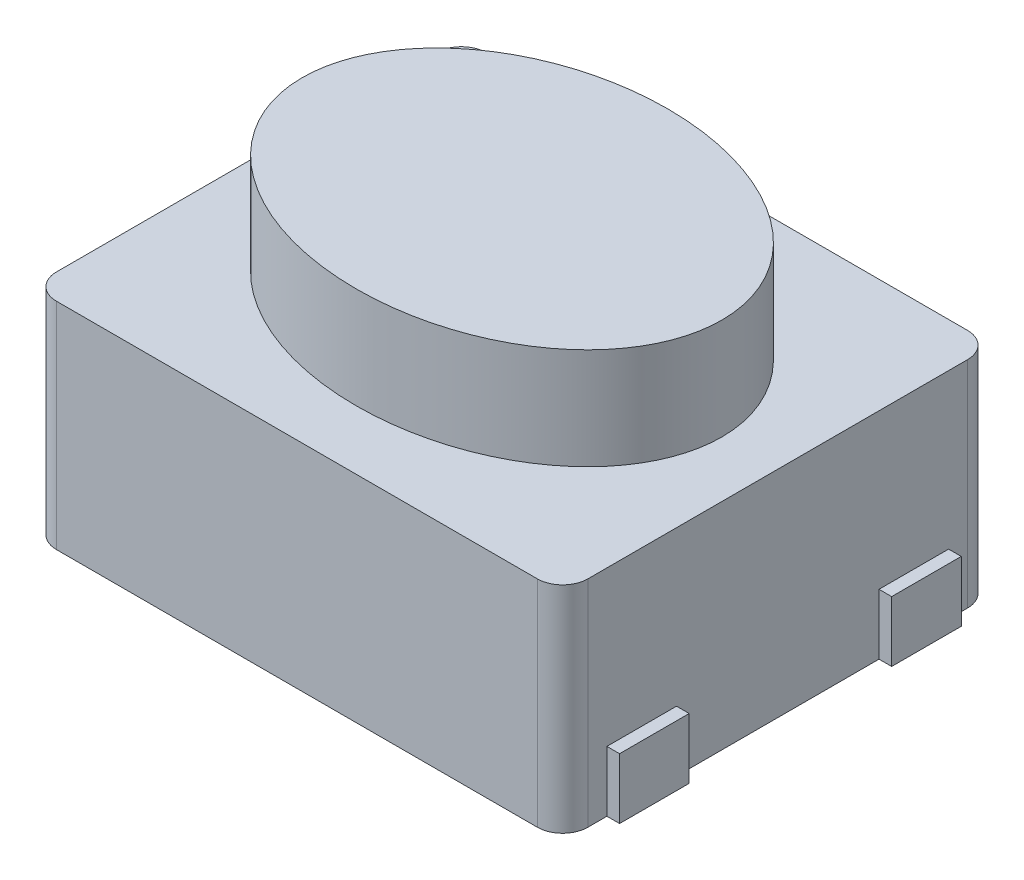
ISO-10303-21;
HEADER;
FILE_DESCRIPTION(('STEP AP214'),'2;1');
FILE_NAME('part.step','',(''),(''),'','','');
FILE_SCHEMA(('AUTOMOTIVE_DESIGN { 1 0 10303 214 1 1 1 1 }'));
ENDSEC;
DATA;
#1=APPLICATION_CONTEXT('core data for automotive mechanical design processes');
#2=APPLICATION_PROTOCOL_DEFINITION('international standard','automotive_design',2000,#1);
#3=PRODUCT_CONTEXT('',#1,'mechanical');
#4=PRODUCT('Part','Part','',(#3));
#5=PRODUCT_RELATED_PRODUCT_CATEGORY('part','',(#4));
#6=PRODUCT_DEFINITION_FORMATION('','',#4);
#7=PRODUCT_DEFINITION_CONTEXT('part definition',#1,'design');
#8=PRODUCT_DEFINITION('design','',#6,#7);
#9=PRODUCT_DEFINITION_SHAPE('','',#8);
#10=(LENGTH_UNIT() NAMED_UNIT(*) SI_UNIT(.MILLI.,.METRE.));
#11=(NAMED_UNIT(*) PLANE_ANGLE_UNIT() SI_UNIT($,.RADIAN.));
#12=(NAMED_UNIT(*) SI_UNIT($,.STERADIAN.) SOLID_ANGLE_UNIT());
#13=UNCERTAINTY_MEASURE_WITH_UNIT(LENGTH_MEASURE(1.E-05),#10,'distance_accuracy_value','');
#14=(GEOMETRIC_REPRESENTATION_CONTEXT(3) GLOBAL_UNCERTAINTY_ASSIGNED_CONTEXT((#13)) GLOBAL_UNIT_ASSIGNED_CONTEXT((#10,
#11,#12)) REPRESENTATION_CONTEXT('',''));
#15=CARTESIAN_POINT('',(0.,0.,0.));
#16=DIRECTION('',(0.,0.,1.));
#17=DIRECTION('',(1.,0.,0.));
#18=AXIS2_PLACEMENT_3D('',#15,#16,#17);
#19=CARTESIAN_POINT('',(-2.1,1.7,1.7));
#20=DIRECTION('',(1.,0.,0.));
#21=DIRECTION('',(0.,0.,-1.));
#22=AXIS2_PLACEMENT_3D('',#19,#20,#21);
#23=PLANE('',#22);
#24=DIRECTION('',(0.,1.,0.));
#25=VECTOR('',#24,1.);
#26=CARTESIAN_POINT('',(-2.1,0.478335134016182,1.35));
#27=LINE('',#26,#25);
#28=CARTESIAN_POINT('',(-2.1,0.,1.35));
#29=VERTEX_POINT('',#28);
#30=CARTESIAN_POINT('',(-2.1,0.478335134016182,1.35));
#31=VERTEX_POINT('',#30);
#32=EDGE_CURVE('E290',#29,#31,#27,.T.);
#33=ORIENTED_EDGE('',*,*,#32,.F.);
#34=DIRECTION('',(0.,0.,1.));
#35=VECTOR('',#34,1.);
#36=CARTESIAN_POINT('',(-2.1,0.,1.7));
#37=LINE('',#36,#35);
#38=CARTESIAN_POINT('',(-2.1,0.,1.5));
#39=VERTEX_POINT('',#38);
#40=EDGE_CURVE('E476',#29,#39,#37,.T.);
#41=ORIENTED_EDGE('',*,*,#40,.T.);
#42=DIRECTION('',(0.,-1.,0.));
#43=VECTOR('',#42,1.);
#44=CARTESIAN_POINT('',(-2.1,1.7,1.5));
#45=LINE('',#44,#43);
#46=CARTESIAN_POINT('',(-2.1,1.7,1.5));
#47=VERTEX_POINT('',#46);
#48=EDGE_CURVE('E448',#39,#47,#45,.F.);
#49=ORIENTED_EDGE('',*,*,#48,.T.);
#50=DIRECTION('',(0.,0.,1.));
#51=VECTOR('',#50,1.);
#52=CARTESIAN_POINT('',(-2.1,1.7,1.7));
#53=LINE('',#52,#51);
#54=CARTESIAN_POINT('',(-2.1,1.7,-1.5));
#55=VERTEX_POINT('',#54);
#56=EDGE_CURVE('E516',#55,#47,#53,.T.);
#57=ORIENTED_EDGE('',*,*,#56,.F.);
#58=DIRECTION('',(0.,-1.,0.));
#59=VECTOR('',#58,1.);
#60=CARTESIAN_POINT('',(-2.1,1.7,-1.5));
#61=LINE('',#60,#59);
#62=CARTESIAN_POINT('',(-2.1,0.,-1.5));
#63=VERTEX_POINT('',#62);
#64=EDGE_CURVE('E451',#55,#63,#61,.T.);
#65=ORIENTED_EDGE('',*,*,#64,.T.);
#66=CARTESIAN_POINT('',(-2.1,0.,-1.35));
#67=VERTEX_POINT('',#66);
#68=EDGE_CURVE('E469',#63,#67,#37,.T.);
#69=ORIENTED_EDGE('',*,*,#68,.T.);
#70=DIRECTION('',(0.,-1.,0.));
#71=VECTOR('',#70,1.);
#72=CARTESIAN_POINT('',(-2.1,0.478335134016182,-1.35));
#73=LINE('',#72,#71);
#74=CARTESIAN_POINT('',(-2.1,0.478335134016182,-1.35));
#75=VERTEX_POINT('',#74);
#76=EDGE_CURVE('E331',#75,#67,#73,.T.);
#77=ORIENTED_EDGE('',*,*,#76,.F.);
#78=DIRECTION('',(0.,0.,-1.));
#79=VECTOR('',#78,1.);
#80=CARTESIAN_POINT('',(-2.1,0.478335134016182,-1.35));
#81=LINE('',#80,#79);
#82=CARTESIAN_POINT('',(-2.1,0.478335134016183,-0.8));
#83=VERTEX_POINT('',#82);
#84=EDGE_CURVE('E337',#83,#75,#81,.T.);
#85=ORIENTED_EDGE('',*,*,#84,.F.);
#86=DIRECTION('',(0.,1.,0.));
#87=VECTOR('',#86,1.);
#88=CARTESIAN_POINT('',(-2.1,0.478335134016183,-0.8));
#89=LINE('',#88,#87);
#90=CARTESIAN_POINT('',(-2.1,0.,-0.8));
#91=VERTEX_POINT('',#90);
#92=EDGE_CURVE('E350',#91,#83,#89,.T.);
#93=ORIENTED_EDGE('',*,*,#92,.F.);
#94=CARTESIAN_POINT('',(-2.1,0.,0.8));
#95=VERTEX_POINT('',#94);
#96=EDGE_CURVE('E474',#91,#95,#37,.T.);
#97=ORIENTED_EDGE('',*,*,#96,.T.);
#98=DIRECTION('',(0.,-1.,0.));
#99=VECTOR('',#98,1.);
#100=CARTESIAN_POINT('',(-2.1,0.478335134016183,0.8));
#101=LINE('',#100,#99);
#102=CARTESIAN_POINT('',(-2.1,0.478335134016183,0.8));
#103=VERTEX_POINT('',#102);
#104=EDGE_CURVE('E296',#103,#95,#101,.T.);
#105=ORIENTED_EDGE('',*,*,#104,.F.);
#106=DIRECTION('',(0.,0.,-1.));
#107=VECTOR('',#106,1.);
#108=CARTESIAN_POINT('',(-2.1,0.478335134016182,1.35));
#109=LINE('',#108,#107);
#110=EDGE_CURVE('E309',#31,#103,#109,.T.);
#111=ORIENTED_EDGE('',*,*,#110,.F.);
#112=EDGE_LOOP('',(#33,#41,#49,#57,#65,#69,#77,#85,#93,#97,#105,#111));
#113=FACE_BOUND('',#112,.T.);
#114=ADVANCED_FACE('F39',(#113),#23,.F.);
#115=CARTESIAN_POINT('',(2.1,1.7,1.7));
#116=DIRECTION('',(-1.,0.,0.));
#117=DIRECTION('',(0.,0.,1.));
#118=AXIS2_PLACEMENT_3D('',#115,#116,#117);
#119=PLANE('',#118);
#120=DIRECTION('',(0.,0.,-1.));
#121=VECTOR('',#120,1.);
#122=CARTESIAN_POINT('',(2.1,0.,1.7));
#123=LINE('',#122,#121);
#124=CARTESIAN_POINT('',(2.1,0.,1.5));
#125=VERTEX_POINT('',#124);
#126=CARTESIAN_POINT('',(2.1,0.,1.35));
#127=VERTEX_POINT('',#126);
#128=EDGE_CURVE('E508',#125,#127,#123,.T.);
#129=ORIENTED_EDGE('',*,*,#128,.T.);
#130=DIRECTION('',(0.,1.,0.));
#131=VECTOR('',#130,1.);
#132=CARTESIAN_POINT('',(2.1,0.478335134016182,1.35));
#133=LINE('',#132,#131);
#134=CARTESIAN_POINT('',(2.1,0.478335134016182,1.35));
#135=VERTEX_POINT('',#134);
#136=EDGE_CURVE('E60',#127,#135,#133,.T.);
#137=ORIENTED_EDGE('',*,*,#136,.T.);
#138=DIRECTION('',(0.,0.,-1.));
#139=VECTOR('',#138,1.);
#140=CARTESIAN_POINT('',(2.1,0.478335134016182,1.35));
#141=LINE('',#140,#139);
#142=CARTESIAN_POINT('',(2.1,0.478335134016183,0.8));
#143=VERTEX_POINT('',#142);
#144=EDGE_CURVE('E55',#135,#143,#141,.T.);
#145=ORIENTED_EDGE('',*,*,#144,.T.);
#146=DIRECTION('',(0.,-1.,0.));
#147=VECTOR('',#146,1.);
#148=CARTESIAN_POINT('',(2.1,0.478335134016183,0.8));
#149=LINE('',#148,#147);
#150=CARTESIAN_POINT('',(2.1,0.,0.8));
#151=VERTEX_POINT('',#150);
#152=EDGE_CURVE('E238',#143,#151,#149,.T.);
#153=ORIENTED_EDGE('',*,*,#152,.T.);
#154=CARTESIAN_POINT('',(2.1,0.,-0.8));
#155=VERTEX_POINT('',#154);
#156=EDGE_CURVE('E511',#151,#155,#123,.T.);
#157=ORIENTED_EDGE('',*,*,#156,.T.);
#158=DIRECTION('',(0.,1.,0.));
#159=VECTOR('',#158,1.);
#160=CARTESIAN_POINT('',(2.1,0.478335134016183,-0.8));
#161=LINE('',#160,#159);
#162=CARTESIAN_POINT('',(2.1,0.478335134016183,-0.8));
#163=VERTEX_POINT('',#162);
#164=EDGE_CURVE('E255',#155,#163,#161,.T.);
#165=ORIENTED_EDGE('',*,*,#164,.T.);
#166=DIRECTION('',(0.,0.,-1.));
#167=VECTOR('',#166,1.);
#168=CARTESIAN_POINT('',(2.1,0.478335134016182,-1.35));
#169=LINE('',#168,#167);
#170=CARTESIAN_POINT('',(2.1,0.478335134016182,-1.35));
#171=VERTEX_POINT('',#170);
#172=EDGE_CURVE('E270',#163,#171,#169,.T.);
#173=ORIENTED_EDGE('',*,*,#172,.T.);
#174=DIRECTION('',(0.,-1.,0.));
#175=VECTOR('',#174,1.);
#176=CARTESIAN_POINT('',(2.1,0.478335134016182,-1.35));
#177=LINE('',#176,#175);
#178=CARTESIAN_POINT('',(2.1,0.,-1.35));
#179=VERTEX_POINT('',#178);
#180=EDGE_CURVE('E209',#171,#179,#177,.T.);
#181=ORIENTED_EDGE('',*,*,#180,.T.);
#182=CARTESIAN_POINT('',(2.1,0.,-1.5));
#183=VERTEX_POINT('',#182);
#184=EDGE_CURVE('E377',#179,#183,#123,.T.);
#185=ORIENTED_EDGE('',*,*,#184,.T.);
#186=DIRECTION('',(0.,-1.,0.));
#187=VECTOR('',#186,1.);
#188=CARTESIAN_POINT('',(2.1,1.7,-1.5));
#189=LINE('',#188,#187);
#190=CARTESIAN_POINT('',(2.1,1.7,-1.5));
#191=VERTEX_POINT('',#190);
#192=EDGE_CURVE('E442',#183,#191,#189,.F.);
#193=ORIENTED_EDGE('',*,*,#192,.T.);
#194=DIRECTION('',(0.,0.,-1.));
#195=VECTOR('',#194,1.);
#196=CARTESIAN_POINT('',(2.1,1.7,1.7));
#197=LINE('',#196,#195);
#198=CARTESIAN_POINT('',(2.1,1.7,1.5));
#199=VERTEX_POINT('',#198);
#200=EDGE_CURVE('E468',#199,#191,#197,.T.);
#201=ORIENTED_EDGE('',*,*,#200,.F.);
#202=DIRECTION('',(0.,-1.,0.));
#203=VECTOR('',#202,1.);
#204=CARTESIAN_POINT('',(2.1,1.7,1.5));
#205=LINE('',#204,#203);
#206=EDGE_CURVE('E428',#199,#125,#205,.T.);
#207=ORIENTED_EDGE('',*,*,#206,.T.);
#208=EDGE_LOOP('',(#129,#137,#145,#153,#157,#165,#173,#181,#185,#193,#201,#207));
#209=FACE_BOUND('',#208,.T.);
#210=ADVANCED_FACE('F401',(#209),#119,.F.);
#211=CARTESIAN_POINT('',(-2.1,1.7,-1.7));
#212=DIRECTION('',(0.,0.,1.));
#213=DIRECTION('',(1.,0.,0.));
#214=AXIS2_PLACEMENT_3D('',#211,#212,#213);
#215=PLANE('',#214);
#216=DIRECTION('',(-1.,0.,0.));
#217=VECTOR('',#216,1.);
#218=CARTESIAN_POINT('',(-2.1,1.7,-1.7));
#219=LINE('',#218,#217);
#220=CARTESIAN_POINT('',(1.9,1.7,-1.7));
#221=VERTEX_POINT('',#220);
#222=CARTESIAN_POINT('',(-1.9,1.7,-1.7));
#223=VERTEX_POINT('',#222);
#224=EDGE_CURVE('E472',#221,#223,#219,.T.);
#225=ORIENTED_EDGE('',*,*,#224,.F.);
#226=DIRECTION('',(0.,-1.,0.));
#227=VECTOR('',#226,1.);
#228=CARTESIAN_POINT('',(1.9,1.7,-1.7));
#229=LINE('',#228,#227);
#230=CARTESIAN_POINT('',(1.9,0.,-1.7));
#231=VERTEX_POINT('',#230);
#232=EDGE_CURVE('E482',#221,#231,#229,.T.);
#233=ORIENTED_EDGE('',*,*,#232,.T.);
#234=DIRECTION('',(-1.,0.,0.));
#235=VECTOR('',#234,1.);
#236=CARTESIAN_POINT('',(-2.1,0.,-1.7));
#237=LINE('',#236,#235);
#238=CARTESIAN_POINT('',(-1.9,0.,-1.7));
#239=VERTEX_POINT('',#238);
#240=EDGE_CURVE('E504',#231,#239,#237,.T.);
#241=ORIENTED_EDGE('',*,*,#240,.T.);
#242=DIRECTION('',(0.,-1.,0.));
#243=VECTOR('',#242,1.);
#244=CARTESIAN_POINT('',(-1.9,1.7,-1.7));
#245=LINE('',#244,#243);
#246=EDGE_CURVE('E479',#239,#223,#245,.F.);
#247=ORIENTED_EDGE('',*,*,#246,.T.);
#248=EDGE_LOOP('',(#225,#233,#241,#247));
#249=FACE_BOUND('',#248,.T.);
#250=ADVANCED_FACE('F397',(#249),#215,.F.);
#251=CARTESIAN_POINT('',(-2.1,1.7,1.7));
#252=DIRECTION('',(0.,0.,-1.));
#253=DIRECTION('',(-1.,0.,0.));
#254=AXIS2_PLACEMENT_3D('',#251,#252,#253);
#255=PLANE('',#254);
#256=DIRECTION('',(1.,0.,0.));
#257=VECTOR('',#256,1.);
#258=CARTESIAN_POINT('',(-2.1,0.,1.7));
#259=LINE('',#258,#257);
#260=CARTESIAN_POINT('',(-1.9,0.,1.7));
#261=VERTEX_POINT('',#260);
#262=CARTESIAN_POINT('',(1.9,0.,1.7));
#263=VERTEX_POINT('',#262);
#264=EDGE_CURVE('E460',#261,#263,#259,.T.);
#265=ORIENTED_EDGE('',*,*,#264,.T.);
#266=DIRECTION('',(0.,-1.,0.));
#267=VECTOR('',#266,1.);
#268=CARTESIAN_POINT('',(1.9,1.7,1.7));
#269=LINE('',#268,#267);
#270=CARTESIAN_POINT('',(1.9,1.7,1.7));
#271=VERTEX_POINT('',#270);
#272=EDGE_CURVE('E11',#263,#271,#269,.F.);
#273=ORIENTED_EDGE('',*,*,#272,.T.);
#274=DIRECTION('',(1.,0.,0.));
#275=VECTOR('',#274,1.);
#276=CARTESIAN_POINT('',(-2.1,1.7,1.7));
#277=LINE('',#276,#275);
#278=CARTESIAN_POINT('',(-1.9,1.7,1.7));
#279=VERTEX_POINT('',#278);
#280=EDGE_CURVE('E461',#279,#271,#277,.T.);
#281=ORIENTED_EDGE('',*,*,#280,.F.);
#282=DIRECTION('',(0.,-1.,0.));
#283=VECTOR('',#282,1.);
#284=CARTESIAN_POINT('',(-1.9,1.7,1.7));
#285=LINE('',#284,#283);
#286=EDGE_CURVE('E48',#279,#261,#285,.T.);
#287=ORIENTED_EDGE('',*,*,#286,.T.);
#288=EDGE_LOOP('',(#265,#273,#281,#287));
#289=FACE_BOUND('',#288,.T.);
#290=ADVANCED_FACE('F391',(#289),#255,.F.);
#291=CARTESIAN_POINT('',(0.,1.7,0.));
#292=DIRECTION('',(0.,-1.,0.));
#293=DIRECTION('',(0.,0.,-1.));
#294=AXIS2_PLACEMENT_3D('',#291,#292,#293);
#295=PLANE('',#294);
#296=CARTESIAN_POINT('',(0.,1.7,0.));
#297=DIRECTION('',(0.,1.,0.));
#298=DIRECTION('',(1.,0.,0.));
#299=AXIS2_PLACEMENT_3D('',#296,#297,#298);
#300=ELLIPSE('',#299,1.65868679245283,1.23169811320755);
#301=CARTESIAN_POINT('',(1.65868679245283,1.7,0.));
#302=VERTEX_POINT('',#301);
#303=EDGE_CURVE('E378',#302,#302,#300,.T.);
#304=ORIENTED_EDGE('',*,*,#303,.F.);
#305=EDGE_LOOP('',(#304));
#306=FACE_BOUND('',#305,.T.);
#307=ORIENTED_EDGE('',*,*,#200,.T.);
#308=CARTESIAN_POINT('',(1.9,1.7,-1.5));
#309=DIRECTION('',(0.,-1.,0.));
#310=DIRECTION('',(0.,0.,-1.));
#311=AXIS2_PLACEMENT_3D('',#308,#309,#310);
#312=CIRCLE('',#311,0.2);
#313=EDGE_CURVE('E439',#191,#221,#312,.F.);
#314=ORIENTED_EDGE('',*,*,#313,.T.);
#315=ORIENTED_EDGE('',*,*,#224,.T.);
#316=CARTESIAN_POINT('',(-1.9,1.7,-1.5));
#317=DIRECTION('',(0.,-1.,0.));
#318=DIRECTION('',(0.,0.,-1.));
#319=AXIS2_PLACEMENT_3D('',#316,#317,#318);
#320=CIRCLE('',#319,0.2);
#321=EDGE_CURVE('E434',#223,#55,#320,.F.);
#322=ORIENTED_EDGE('',*,*,#321,.T.);
#323=ORIENTED_EDGE('',*,*,#56,.T.);
#324=CARTESIAN_POINT('',(-1.9,1.7,1.5));
#325=DIRECTION('',(0.,-1.,0.));
#326=DIRECTION('',(0.,0.,-1.));
#327=AXIS2_PLACEMENT_3D('',#324,#325,#326);
#328=CIRCLE('',#327,0.2);
#329=EDGE_CURVE('E435',#47,#279,#328,.F.);
#330=ORIENTED_EDGE('',*,*,#329,.T.);
#331=ORIENTED_EDGE('',*,*,#280,.T.);
#332=CARTESIAN_POINT('',(1.9,1.7,1.5));
#333=DIRECTION('',(0.,-1.,0.));
#334=DIRECTION('',(0.,0.,-1.));
#335=AXIS2_PLACEMENT_3D('',#332,#333,#334);
#336=CIRCLE('',#335,0.2);
#337=EDGE_CURVE('E426',#271,#199,#336,.F.);
#338=ORIENTED_EDGE('',*,*,#337,.T.);
#339=EDGE_LOOP('',(#307,#314,#315,#322,#323,#330,#331,#338));
#340=FACE_BOUND('',#339,.T.);
#341=ADVANCED_FACE('F388',(#306,#340),#295,.F.);
#342=CARTESIAN_POINT('',(0.,0.,0.));
#343=DIRECTION('',(0.,-1.,0.));
#344=DIRECTION('',(0.,0.,-1.));
#345=AXIS2_PLACEMENT_3D('',#342,#343,#344);
#346=PLANE('',#345);
#347=ORIENTED_EDGE('',*,*,#240,.F.);
#348=CARTESIAN_POINT('',(1.9,0.,-1.5));
#349=DIRECTION('',(0.,-1.,0.));
#350=DIRECTION('',(0.,0.,-1.));
#351=AXIS2_PLACEMENT_3D('',#348,#349,#350);
#352=CIRCLE('',#351,0.2);
#353=EDGE_CURVE('E491',#231,#183,#352,.T.);
#354=ORIENTED_EDGE('',*,*,#353,.T.);
#355=ORIENTED_EDGE('',*,*,#184,.F.);
#356=DIRECTION('',(-1.,0.,0.));
#357=VECTOR('',#356,1.);
#358=CARTESIAN_POINT('',(2.2,0.,-1.35));
#359=LINE('',#358,#357);
#360=CARTESIAN_POINT('',(2.2,0.,-1.35));
#361=VERTEX_POINT('',#360);
#362=EDGE_CURVE('E266',#361,#179,#359,.T.);
#363=ORIENTED_EDGE('',*,*,#362,.F.);
#364=DIRECTION('',(0.,0.,1.));
#365=VECTOR('',#364,1.);
#366=CARTESIAN_POINT('',(2.2,0.,-1.35));
#367=LINE('',#366,#365);
#368=CARTESIAN_POINT('',(2.2,0.,-0.8));
#369=VERTEX_POINT('',#368);
#370=EDGE_CURVE('E263',#361,#369,#367,.T.);
#371=ORIENTED_EDGE('',*,*,#370,.T.);
#372=DIRECTION('',(-1.,0.,0.));
#373=VECTOR('',#372,1.);
#374=CARTESIAN_POINT('',(2.2,0.,-0.8));
#375=LINE('',#374,#373);
#376=EDGE_CURVE('E278',#369,#155,#375,.T.);
#377=ORIENTED_EDGE('',*,*,#376,.T.);
#378=ORIENTED_EDGE('',*,*,#156,.F.);
#379=DIRECTION('',(-1.,0.,0.));
#380=VECTOR('',#379,1.);
#381=CARTESIAN_POINT('',(2.2,0.,0.8));
#382=LINE('',#381,#380);
#383=CARTESIAN_POINT('',(2.2,0.,0.8));
#384=VERTEX_POINT('',#383);
#385=EDGE_CURVE('E210',#384,#151,#382,.T.);
#386=ORIENTED_EDGE('',*,*,#385,.F.);
#387=DIRECTION('',(0.,0.,1.));
#388=VECTOR('',#387,1.);
#389=CARTESIAN_POINT('',(2.2,0.,1.35));
#390=LINE('',#389,#388);
#391=CARTESIAN_POINT('',(2.2,0.,1.35));
#392=VERTEX_POINT('',#391);
#393=EDGE_CURVE('E216',#384,#392,#390,.T.);
#394=ORIENTED_EDGE('',*,*,#393,.T.);
#395=DIRECTION('',(-1.,0.,0.));
#396=VECTOR('',#395,1.);
#397=CARTESIAN_POINT('',(2.2,0.,1.35));
#398=LINE('',#397,#396);
#399=EDGE_CURVE('E200',#392,#127,#398,.T.);
#400=ORIENTED_EDGE('',*,*,#399,.T.);
#401=ORIENTED_EDGE('',*,*,#128,.F.);
#402=CARTESIAN_POINT('',(1.9,0.,1.5));
#403=DIRECTION('',(0.,-1.,0.));
#404=DIRECTION('',(0.,0.,-1.));
#405=AXIS2_PLACEMENT_3D('',#402,#403,#404);
#406=CIRCLE('',#405,0.2);
#407=EDGE_CURVE('E466',#125,#263,#406,.T.);
#408=ORIENTED_EDGE('',*,*,#407,.T.);
#409=ORIENTED_EDGE('',*,*,#264,.F.);
#410=CARTESIAN_POINT('',(-1.9,0.,1.5));
#411=DIRECTION('',(0.,-1.,0.));
#412=DIRECTION('',(0.,0.,-1.));
#413=AXIS2_PLACEMENT_3D('',#410,#411,#412);
#414=CIRCLE('',#413,0.2);
#415=EDGE_CURVE('E464',#261,#39,#414,.T.);
#416=ORIENTED_EDGE('',*,*,#415,.T.);
#417=ORIENTED_EDGE('',*,*,#40,.F.);
#418=DIRECTION('',(1.,0.,0.));
#419=VECTOR('',#418,1.);
#420=CARTESIAN_POINT('',(-2.2,0.,1.35));
#421=LINE('',#420,#419);
#422=CARTESIAN_POINT('',(-2.2,0.,1.35));
#423=VERTEX_POINT('',#422);
#424=EDGE_CURVE('E305',#423,#29,#421,.T.);
#425=ORIENTED_EDGE('',*,*,#424,.F.);
#426=DIRECTION('',(0.,0.,1.));
#427=VECTOR('',#426,1.);
#428=CARTESIAN_POINT('',(-2.2,0.,1.35));
#429=LINE('',#428,#427);
#430=CARTESIAN_POINT('',(-2.2,0.,0.8));
#431=VERTEX_POINT('',#430);
#432=EDGE_CURVE('E302',#431,#423,#429,.T.);
#433=ORIENTED_EDGE('',*,*,#432,.F.);
#434=DIRECTION('',(1.,0.,0.));
#435=VECTOR('',#434,1.);
#436=CARTESIAN_POINT('',(-2.2,0.,0.8));
#437=LINE('',#436,#435);
#438=EDGE_CURVE('E319',#431,#95,#437,.T.);
#439=ORIENTED_EDGE('',*,*,#438,.T.);
#440=ORIENTED_EDGE('',*,*,#96,.F.);
#441=DIRECTION('',(1.,0.,0.));
#442=VECTOR('',#441,1.);
#443=CARTESIAN_POINT('',(-2.2,0.,-0.8));
#444=LINE('',#443,#442);
#445=CARTESIAN_POINT('',(-2.2,0.,-0.8));
#446=VERTEX_POINT('',#445);
#447=EDGE_CURVE('E364',#446,#91,#444,.T.);
#448=ORIENTED_EDGE('',*,*,#447,.F.);
#449=DIRECTION('',(0.,0.,1.));
#450=VECTOR('',#449,1.);
#451=CARTESIAN_POINT('',(-2.2,0.,-1.35));
#452=LINE('',#451,#450);
#453=CARTESIAN_POINT('',(-2.2,0.,-1.35));
#454=VERTEX_POINT('',#453);
#455=EDGE_CURVE('E336',#454,#446,#452,.T.);
#456=ORIENTED_EDGE('',*,*,#455,.F.);
#457=DIRECTION('',(1.,0.,0.));
#458=VECTOR('',#457,1.);
#459=CARTESIAN_POINT('',(-2.2,0.,-1.35));
#460=LINE('',#459,#458);
#461=EDGE_CURVE('E368',#454,#67,#460,.T.);
#462=ORIENTED_EDGE('',*,*,#461,.T.);
#463=ORIENTED_EDGE('',*,*,#68,.F.);
#464=CARTESIAN_POINT('',(-1.9,0.,-1.5));
#465=DIRECTION('',(0.,-1.,0.));
#466=DIRECTION('',(0.,0.,-1.));
#467=AXIS2_PLACEMENT_3D('',#464,#465,#466);
#468=CIRCLE('',#467,0.2);
#469=EDGE_CURVE('E489',#63,#239,#468,.T.);
#470=ORIENTED_EDGE('',*,*,#469,.T.);
#471=EDGE_LOOP('',(#347,#354,#355,#363,#371,#377,#378,#386,#394,#400,#401,#408,#409,#416,#417,
#425,#433,#439,#440,#448,#456,#462,#463,#470));
#472=FACE_BOUND('',#471,.T.);
#473=ADVANCED_FACE('F223',(#472),#346,.T.);
#474=CARTESIAN_POINT('',(0.,2.5,0.));
#475=DIRECTION('',(0.,1.,0.));
#476=DIRECTION('',(1.,0.,0.));
#477=AXIS2_PLACEMENT_3D('',#474,#475,#476);
#478=ELLIPSE('',#477,1.65868679245283,1.23169811320755);
#479=DIRECTION('',(0.,-1.,0.));
#480=VECTOR('',#479,1.);
#481=SURFACE_OF_LINEAR_EXTRUSION('',#478,#480);
#482=CARTESIAN_POINT('',(1.65868679245283,2.5,0.));
#483=VERTEX_POINT('',#482);
#484=EDGE_CURVE('E372',#483,#483,#478,.T.);
#485=ORIENTED_EDGE('',*,*,#484,.F.);
#486=EDGE_LOOP('',(#485));
#487=FACE_BOUND('',#486,.T.);
#488=ORIENTED_EDGE('',*,*,#303,.T.);
#489=EDGE_LOOP('',(#488));
#490=FACE_BOUND('',#489,.T.);
#491=ADVANCED_FACE('F381',(#487,#490),#481,.F.);
#492=CARTESIAN_POINT('',(0.,2.5,0.));
#493=DIRECTION('',(0.,1.,0.));
#494=DIRECTION('',(0.,0.,1.));
#495=AXIS2_PLACEMENT_3D('',#492,#493,#494);
#496=PLANE('',#495);
#497=ORIENTED_EDGE('',*,*,#484,.T.);
#498=EDGE_LOOP('',(#497));
#499=FACE_BOUND('',#498,.T.);
#500=ADVANCED_FACE('F385',(#499),#496,.T.);
#501=CARTESIAN_POINT('',(1.9,1.7,-1.5));
#502=DIRECTION('',(0.,-1.,0.));
#503=DIRECTION('',(0.,0.,-1.));
#504=AXIS2_PLACEMENT_3D('',#501,#502,#503);
#505=CYLINDRICAL_SURFACE('',#504,0.2);
#506=ORIENTED_EDGE('',*,*,#313,.F.);
#507=ORIENTED_EDGE('',*,*,#192,.F.);
#508=ORIENTED_EDGE('',*,*,#353,.F.);
#509=ORIENTED_EDGE('',*,*,#232,.F.);
#510=EDGE_LOOP('',(#506,#507,#508,#509));
#511=FACE_BOUND('',#510,.T.);
#512=ADVANCED_FACE('F408',(#511),#505,.T.);
#513=CARTESIAN_POINT('',(-1.9,1.7,-1.5));
#514=DIRECTION('',(0.,-1.,0.));
#515=DIRECTION('',(0.,0.,-1.));
#516=AXIS2_PLACEMENT_3D('',#513,#514,#515);
#517=CYLINDRICAL_SURFACE('',#516,0.2);
#518=ORIENTED_EDGE('',*,*,#321,.F.);
#519=ORIENTED_EDGE('',*,*,#246,.F.);
#520=ORIENTED_EDGE('',*,*,#469,.F.);
#521=ORIENTED_EDGE('',*,*,#64,.F.);
#522=EDGE_LOOP('',(#518,#519,#520,#521));
#523=FACE_BOUND('',#522,.T.);
#524=ADVANCED_FACE('F411',(#523),#517,.T.);
#525=CARTESIAN_POINT('',(1.9,1.7,1.5));
#526=DIRECTION('',(0.,-1.,0.));
#527=DIRECTION('',(0.,0.,-1.));
#528=AXIS2_PLACEMENT_3D('',#525,#526,#527);
#529=CYLINDRICAL_SURFACE('',#528,0.2);
#530=ORIENTED_EDGE('',*,*,#337,.F.);
#531=ORIENTED_EDGE('',*,*,#272,.F.);
#532=ORIENTED_EDGE('',*,*,#407,.F.);
#533=ORIENTED_EDGE('',*,*,#206,.F.);
#534=EDGE_LOOP('',(#530,#531,#532,#533));
#535=FACE_BOUND('',#534,.T.);
#536=ADVANCED_FACE('F414',(#535),#529,.T.);
#537=CARTESIAN_POINT('',(-1.9,1.7,1.5));
#538=DIRECTION('',(0.,-1.,0.));
#539=DIRECTION('',(0.,0.,-1.));
#540=AXIS2_PLACEMENT_3D('',#537,#538,#539);
#541=CYLINDRICAL_SURFACE('',#540,0.2);
#542=ORIENTED_EDGE('',*,*,#329,.F.);
#543=ORIENTED_EDGE('',*,*,#48,.F.);
#544=ORIENTED_EDGE('',*,*,#415,.F.);
#545=ORIENTED_EDGE('',*,*,#286,.F.);
#546=EDGE_LOOP('',(#542,#543,#544,#545));
#547=FACE_BOUND('',#546,.T.);
#548=ADVANCED_FACE('F41',(#547),#541,.T.);
#549=CARTESIAN_POINT('',(-2.2,0.478335134016182,-1.35));
#550=DIRECTION('',(0.,0.,1.));
#551=DIRECTION('',(1.,0.,0.));
#552=AXIS2_PLACEMENT_3D('',#549,#550,#551);
#553=PLANE('',#552);
#554=ORIENTED_EDGE('',*,*,#76,.T.);
#555=ORIENTED_EDGE('',*,*,#461,.F.);
#556=DIRECTION('',(0.,-1.,0.));
#557=VECTOR('',#556,1.);
#558=CARTESIAN_POINT('',(-2.2,0.478335134016182,-1.35));
#559=LINE('',#558,#557);
#560=CARTESIAN_POINT('',(-2.2,0.478335134016182,-1.35));
#561=VERTEX_POINT('',#560);
#562=EDGE_CURVE('E332',#561,#454,#559,.T.);
#563=ORIENTED_EDGE('',*,*,#562,.F.);
#564=DIRECTION('',(1.,0.,0.));
#565=VECTOR('',#564,1.);
#566=CARTESIAN_POINT('',(-2.2,0.478335134016182,-1.35));
#567=LINE('',#566,#565);
#568=EDGE_CURVE('E346',#561,#75,#567,.T.);
#569=ORIENTED_EDGE('',*,*,#568,.T.);
#570=EDGE_LOOP('',(#554,#555,#563,#569));
#571=FACE_BOUND('',#570,.T.);
#572=ADVANCED_FACE('F421',(#571),#553,.F.);
#573=CARTESIAN_POINT('',(-2.2,0.478335134016183,-0.8));
#574=DIRECTION('',(0.,0.,-1.));
#575=DIRECTION('',(0.,1.,0.));
#576=AXIS2_PLACEMENT_3D('',#573,#574,#575);
#577=PLANE('',#576);
#578=ORIENTED_EDGE('',*,*,#92,.T.);
#579=DIRECTION('',(1.,0.,0.));
#580=VECTOR('',#579,1.);
#581=CARTESIAN_POINT('',(-2.2,0.478335134016183,-0.8));
#582=LINE('',#581,#580);
#583=CARTESIAN_POINT('',(-2.2,0.478335134016183,-0.8));
#584=VERTEX_POINT('',#583);
#585=EDGE_CURVE('E360',#584,#83,#582,.T.);
#586=ORIENTED_EDGE('',*,*,#585,.F.);
#587=DIRECTION('',(0.,1.,0.));
#588=VECTOR('',#587,1.);
#589=CARTESIAN_POINT('',(-2.2,0.478335134016183,-0.8));
#590=LINE('',#589,#588);
#591=EDGE_CURVE('E340',#446,#584,#590,.T.);
#592=ORIENTED_EDGE('',*,*,#591,.F.);
#593=ORIENTED_EDGE('',*,*,#447,.T.);
#594=EDGE_LOOP('',(#578,#586,#592,#593));
#595=FACE_BOUND('',#594,.T.);
#596=ADVANCED_FACE('F538',(#595),#577,.F.);
#597=CARTESIAN_POINT('',(-2.2,0.478335134016182,-1.35));
#598=DIRECTION('',(0.,-1.,0.));
#599=DIRECTION('',(0.,0.,-1.));
#600=AXIS2_PLACEMENT_3D('',#597,#598,#599);
#601=PLANE('',#600);
#602=ORIENTED_EDGE('',*,*,#84,.T.);
#603=ORIENTED_EDGE('',*,*,#568,.F.);
#604=DIRECTION('',(0.,0.,-1.));
#605=VECTOR('',#604,1.);
#606=CARTESIAN_POINT('',(-2.2,0.478335134016182,-1.35));
#607=LINE('',#606,#605);
#608=EDGE_CURVE('E343',#584,#561,#607,.T.);
#609=ORIENTED_EDGE('',*,*,#608,.F.);
#610=ORIENTED_EDGE('',*,*,#585,.T.);
#611=EDGE_LOOP('',(#602,#603,#609,#610));
#612=FACE_BOUND('',#611,.T.);
#613=ADVANCED_FACE('F533',(#612),#601,.F.);
#614=CARTESIAN_POINT('',(-2.2,0.,0.));
#615=DIRECTION('',(-1.,0.,0.));
#616=DIRECTION('',(0.,0.,1.));
#617=AXIS2_PLACEMENT_3D('',#614,#615,#616);
#618=PLANE('',#617);
#619=ORIENTED_EDGE('',*,*,#562,.T.);
#620=ORIENTED_EDGE('',*,*,#455,.T.);
#621=ORIENTED_EDGE('',*,*,#591,.T.);
#622=ORIENTED_EDGE('',*,*,#608,.T.);
#623=EDGE_LOOP('',(#619,#620,#621,#622));
#624=FACE_BOUND('',#623,.T.);
#625=ADVANCED_FACE('F556',(#624),#618,.T.);
#626=CARTESIAN_POINT('',(-2.2,0.478335134016182,1.35));
#627=DIRECTION('',(0.,0.,-1.));
#628=DIRECTION('',(-1.,0.,0.));
#629=AXIS2_PLACEMENT_3D('',#626,#627,#628);
#630=PLANE('',#629);
#631=ORIENTED_EDGE('',*,*,#32,.T.);
#632=DIRECTION('',(1.,0.,0.));
#633=VECTOR('',#632,1.);
#634=CARTESIAN_POINT('',(-2.2,0.478335134016182,1.35));
#635=LINE('',#634,#633);
#636=CARTESIAN_POINT('',(-2.2,0.478335134016182,1.35));
#637=VERTEX_POINT('',#636);
#638=EDGE_CURVE('E327',#637,#31,#635,.T.);
#639=ORIENTED_EDGE('',*,*,#638,.F.);
#640=DIRECTION('',(0.,1.,0.));
#641=VECTOR('',#640,1.);
#642=CARTESIAN_POINT('',(-2.2,0.478335134016182,1.35));
#643=LINE('',#642,#641);
#644=EDGE_CURVE('E291',#423,#637,#643,.T.);
#645=ORIENTED_EDGE('',*,*,#644,.F.);
#646=ORIENTED_EDGE('',*,*,#424,.T.);
#647=EDGE_LOOP('',(#631,#639,#645,#646));
#648=FACE_BOUND('',#647,.T.);
#649=ADVANCED_FACE('F554',(#648),#630,.F.);
#650=CARTESIAN_POINT('',(-2.2,0.478335134016182,1.35));
#651=DIRECTION('',(0.,-1.,0.));
#652=DIRECTION('',(0.,0.,-1.));
#653=AXIS2_PLACEMENT_3D('',#650,#651,#652);
#654=PLANE('',#653);
#655=ORIENTED_EDGE('',*,*,#110,.T.);
#656=DIRECTION('',(1.,0.,0.));
#657=VECTOR('',#656,1.);
#658=CARTESIAN_POINT('',(-2.2,0.478335134016183,0.8));
#659=LINE('',#658,#657);
#660=CARTESIAN_POINT('',(-2.2,0.478335134016183,0.8));
#661=VERTEX_POINT('',#660);
#662=EDGE_CURVE('E323',#661,#103,#659,.T.);
#663=ORIENTED_EDGE('',*,*,#662,.F.);
#664=DIRECTION('',(0.,0.,-1.));
#665=VECTOR('',#664,1.);
#666=CARTESIAN_POINT('',(-2.2,0.478335134016182,1.35));
#667=LINE('',#666,#665);
#668=EDGE_CURVE('E295',#637,#661,#667,.T.);
#669=ORIENTED_EDGE('',*,*,#668,.F.);
#670=ORIENTED_EDGE('',*,*,#638,.T.);
#671=EDGE_LOOP('',(#655,#663,#669,#670));
#672=FACE_BOUND('',#671,.T.);
#673=ADVANCED_FACE('F552',(#672),#654,.F.);
#674=CARTESIAN_POINT('',(-2.2,0.478335134016183,0.8));
#675=DIRECTION('',(0.,0.,1.));
#676=DIRECTION('',(0.,-1.,0.));
#677=AXIS2_PLACEMENT_3D('',#674,#675,#676);
#678=PLANE('',#677);
#679=ORIENTED_EDGE('',*,*,#104,.T.);
#680=ORIENTED_EDGE('',*,*,#438,.F.);
#681=DIRECTION('',(0.,-1.,0.));
#682=VECTOR('',#681,1.);
#683=CARTESIAN_POINT('',(-2.2,0.478335134016183,0.8));
#684=LINE('',#683,#682);
#685=EDGE_CURVE('E299',#661,#431,#684,.T.);
#686=ORIENTED_EDGE('',*,*,#685,.F.);
#687=ORIENTED_EDGE('',*,*,#662,.T.);
#688=EDGE_LOOP('',(#679,#680,#686,#687));
#689=FACE_BOUND('',#688,.T.);
#690=ADVANCED_FACE('F542',(#689),#678,.F.);
#691=CARTESIAN_POINT('',(-2.2,0.,0.));
#692=DIRECTION('',(1.,0.,0.));
#693=DIRECTION('',(0.,0.,-1.));
#694=AXIS2_PLACEMENT_3D('',#691,#692,#693);
#695=PLANE('',#694);
#696=ORIENTED_EDGE('',*,*,#644,.T.);
#697=ORIENTED_EDGE('',*,*,#668,.T.);
#698=ORIENTED_EDGE('',*,*,#685,.T.);
#699=ORIENTED_EDGE('',*,*,#432,.T.);
#700=EDGE_LOOP('',(#696,#697,#698,#699));
#701=FACE_BOUND('',#700,.T.);
#702=ADVANCED_FACE('F549',(#701),#695,.F.);
#703=CARTESIAN_POINT('',(2.2,0.478335134016182,-1.35));
#704=DIRECTION('',(0.,0.,-1.));
#705=DIRECTION('',(-1.,0.,0.));
#706=AXIS2_PLACEMENT_3D('',#703,#704,#705);
#707=PLANE('',#706);
#708=ORIENTED_EDGE('',*,*,#180,.F.);
#709=DIRECTION('',(-1.,0.,0.));
#710=VECTOR('',#709,1.);
#711=CARTESIAN_POINT('',(2.2,0.478335134016182,-1.35));
#712=LINE('',#711,#710);
#713=CARTESIAN_POINT('',(2.2,0.478335134016182,-1.35));
#714=VERTEX_POINT('',#713);
#715=EDGE_CURVE('E286',#714,#171,#712,.T.);
#716=ORIENTED_EDGE('',*,*,#715,.F.);
#717=DIRECTION('',(0.,-1.,0.));
#718=VECTOR('',#717,1.);
#719=CARTESIAN_POINT('',(2.2,0.478335134016182,-1.35));
#720=LINE('',#719,#718);
#721=EDGE_CURVE('E250',#714,#361,#720,.T.);
#722=ORIENTED_EDGE('',*,*,#721,.T.);
#723=ORIENTED_EDGE('',*,*,#362,.T.);
#724=EDGE_LOOP('',(#708,#716,#722,#723));
#725=FACE_BOUND('',#724,.T.);
#726=ADVANCED_FACE('F605',(#725),#707,.T.);
#727=CARTESIAN_POINT('',(2.2,0.478335134016182,-1.35));
#728=DIRECTION('',(0.,1.,0.));
#729=DIRECTION('',(0.,0.,1.));
#730=AXIS2_PLACEMENT_3D('',#727,#728,#729);
#731=PLANE('',#730);
#732=ORIENTED_EDGE('',*,*,#172,.F.);
#733=DIRECTION('',(-1.,0.,0.));
#734=VECTOR('',#733,1.);
#735=CARTESIAN_POINT('',(2.2,0.478335134016183,-0.8));
#736=LINE('',#735,#734);
#737=CARTESIAN_POINT('',(2.2,0.478335134016183,-0.8));
#738=VERTEX_POINT('',#737);
#739=EDGE_CURVE('E282',#738,#163,#736,.T.);
#740=ORIENTED_EDGE('',*,*,#739,.F.);
#741=DIRECTION('',(0.,0.,-1.));
#742=VECTOR('',#741,1.);
#743=CARTESIAN_POINT('',(2.2,0.478335134016182,-1.35));
#744=LINE('',#743,#742);
#745=EDGE_CURVE('E254',#738,#714,#744,.T.);
#746=ORIENTED_EDGE('',*,*,#745,.T.);
#747=ORIENTED_EDGE('',*,*,#715,.T.);
#748=EDGE_LOOP('',(#732,#740,#746,#747));
#749=FACE_BOUND('',#748,.T.);
#750=ADVANCED_FACE('F614',(#749),#731,.T.);
#751=CARTESIAN_POINT('',(2.2,0.478335134016183,-0.8));
#752=DIRECTION('',(0.,0.,1.));
#753=DIRECTION('',(0.,-1.,0.));
#754=AXIS2_PLACEMENT_3D('',#751,#752,#753);
#755=PLANE('',#754);
#756=ORIENTED_EDGE('',*,*,#164,.F.);
#757=ORIENTED_EDGE('',*,*,#376,.F.);
#758=DIRECTION('',(0.,1.,0.));
#759=VECTOR('',#758,1.);
#760=CARTESIAN_POINT('',(2.2,0.478335134016183,-0.8));
#761=LINE('',#760,#759);
#762=EDGE_CURVE('E259',#369,#738,#761,.T.);
#763=ORIENTED_EDGE('',*,*,#762,.T.);
#764=ORIENTED_EDGE('',*,*,#739,.T.);
#765=EDGE_LOOP('',(#756,#757,#763,#764));
#766=FACE_BOUND('',#765,.T.);
#767=ADVANCED_FACE('F624',(#766),#755,.T.);
#768=CARTESIAN_POINT('',(2.2,0.,0.));
#769=DIRECTION('',(1.,0.,0.));
#770=DIRECTION('',(0.,0.,1.));
#771=AXIS2_PLACEMENT_3D('',#768,#769,#770);
#772=PLANE('',#771);
#773=ORIENTED_EDGE('',*,*,#721,.F.);
#774=ORIENTED_EDGE('',*,*,#745,.F.);
#775=ORIENTED_EDGE('',*,*,#762,.F.);
#776=ORIENTED_EDGE('',*,*,#370,.F.);
#777=EDGE_LOOP('',(#773,#774,#775,#776));
#778=FACE_BOUND('',#777,.T.);
#779=ADVANCED_FACE('F633',(#778),#772,.T.);
#780=CARTESIAN_POINT('',(2.2,0.478335134016182,1.35));
#781=DIRECTION('',(0.,0.,1.));
#782=DIRECTION('',(1.,0.,0.));
#783=AXIS2_PLACEMENT_3D('',#780,#781,#782);
#784=PLANE('',#783);
#785=ORIENTED_EDGE('',*,*,#136,.F.);
#786=ORIENTED_EDGE('',*,*,#399,.F.);
#787=DIRECTION('',(0.,1.,0.));
#788=VECTOR('',#787,1.);
#789=CARTESIAN_POINT('',(2.2,0.478335134016182,1.35));
#790=LINE('',#789,#788);
#791=CARTESIAN_POINT('',(2.2,0.478335134016182,1.35));
#792=VERTEX_POINT('',#791);
#793=EDGE_CURVE('E203',#392,#792,#790,.T.);
#794=ORIENTED_EDGE('',*,*,#793,.T.);
#795=DIRECTION('',(-1.,0.,0.));
#796=VECTOR('',#795,1.);
#797=CARTESIAN_POINT('',(2.2,0.478335134016182,1.35));
#798=LINE('',#797,#796);
#799=EDGE_CURVE('E235',#792,#135,#798,.T.);
#800=ORIENTED_EDGE('',*,*,#799,.T.);
#801=EDGE_LOOP('',(#785,#786,#794,#800));
#802=FACE_BOUND('',#801,.T.);
#803=ADVANCED_FACE('F202',(#802),#784,.T.);
#804=CARTESIAN_POINT('',(2.2,0.478335134016183,0.8));
#805=DIRECTION('',(0.,0.,-1.));
#806=DIRECTION('',(0.,1.,0.));
#807=AXIS2_PLACEMENT_3D('',#804,#805,#806);
#808=PLANE('',#807);
#809=ORIENTED_EDGE('',*,*,#152,.F.);
#810=DIRECTION('',(-1.,0.,0.));
#811=VECTOR('',#810,1.);
#812=CARTESIAN_POINT('',(2.2,0.478335134016183,0.8));
#813=LINE('',#812,#811);
#814=CARTESIAN_POINT('',(2.2,0.478335134016183,0.8));
#815=VERTEX_POINT('',#814);
#816=EDGE_CURVE('E245',#815,#143,#813,.T.);
#817=ORIENTED_EDGE('',*,*,#816,.F.);
#818=DIRECTION('',(0.,-1.,0.));
#819=VECTOR('',#818,1.);
#820=CARTESIAN_POINT('',(2.2,0.478335134016183,0.8));
#821=LINE('',#820,#819);
#822=EDGE_CURVE('E226',#815,#384,#821,.T.);
#823=ORIENTED_EDGE('',*,*,#822,.T.);
#824=ORIENTED_EDGE('',*,*,#385,.T.);
#825=EDGE_LOOP('',(#809,#817,#823,#824));
#826=FACE_BOUND('',#825,.T.);
#827=ADVANCED_FACE('F650',(#826),#808,.T.);
#828=CARTESIAN_POINT('',(2.2,0.478335134016182,1.35));
#829=DIRECTION('',(0.,1.,0.));
#830=DIRECTION('',(0.,0.,1.));
#831=AXIS2_PLACEMENT_3D('',#828,#829,#830);
#832=PLANE('',#831);
#833=ORIENTED_EDGE('',*,*,#144,.F.);
#834=ORIENTED_EDGE('',*,*,#799,.F.);
#835=DIRECTION('',(0.,0.,-1.));
#836=VECTOR('',#835,1.);
#837=CARTESIAN_POINT('',(2.2,0.478335134016182,1.35));
#838=LINE('',#837,#836);
#839=EDGE_CURVE('E219',#792,#815,#838,.T.);
#840=ORIENTED_EDGE('',*,*,#839,.T.);
#841=ORIENTED_EDGE('',*,*,#816,.T.);
#842=EDGE_LOOP('',(#833,#834,#840,#841));
#843=FACE_BOUND('',#842,.T.);
#844=ADVANCED_FACE('F658',(#843),#832,.T.);
#845=CARTESIAN_POINT('',(2.2,0.,0.));
#846=DIRECTION('',(-1.,0.,0.));
#847=DIRECTION('',(0.,0.,-1.));
#848=AXIS2_PLACEMENT_3D('',#845,#846,#847);
#849=PLANE('',#848);
#850=ORIENTED_EDGE('',*,*,#793,.F.);
#851=ORIENTED_EDGE('',*,*,#393,.F.);
#852=ORIENTED_EDGE('',*,*,#822,.F.);
#853=ORIENTED_EDGE('',*,*,#839,.F.);
#854=EDGE_LOOP('',(#850,#851,#852,#853));
#855=FACE_BOUND('',#854,.T.);
#856=ADVANCED_FACE('F214',(#855),#849,.F.);
#857=CLOSED_SHELL('',(#114,#210,#250,#290,#341,#473,#491,#500,#512,#524,#536,#548,#572,#596,
#613,#625,#649,#673,#690,#702,#726,#750,#767,#779,#803,#827,#844,#856));
#858=MANIFOLD_SOLID_BREP('B2',#857);
#859=ADVANCED_BREP_SHAPE_REPRESENTATION('',(#18,#858),#14);
#860=SHAPE_DEFINITION_REPRESENTATION(#9,#859);
ENDSEC;
END-ISO-10303-21;
